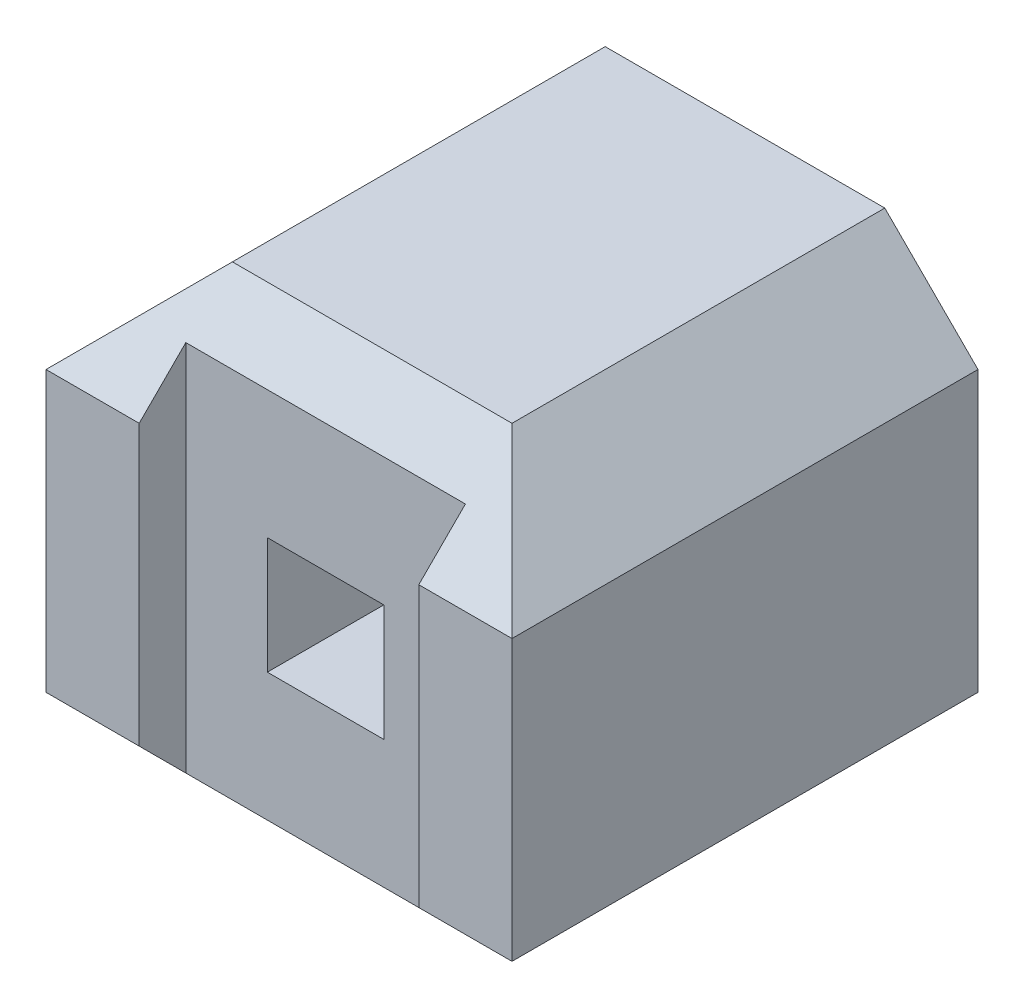
ISO-10303-21;
HEADER;
FILE_DESCRIPTION(('STEP AP214'),'2;1');
FILE_NAME('part.step','',(''),(''),'','','');
FILE_SCHEMA(('AUTOMOTIVE_DESIGN { 1 0 10303 214 1 1 1 1 }'));
ENDSEC;
DATA;
#1=APPLICATION_CONTEXT('core data for automotive mechanical design processes');
#2=APPLICATION_PROTOCOL_DEFINITION('international standard','automotive_design',2000,#1);
#3=PRODUCT_CONTEXT('',#1,'mechanical');
#4=PRODUCT('Part','Part','',(#3));
#5=PRODUCT_RELATED_PRODUCT_CATEGORY('part','',(#4));
#6=PRODUCT_DEFINITION_FORMATION('','',#4);
#7=PRODUCT_DEFINITION_CONTEXT('part definition',#1,'design');
#8=PRODUCT_DEFINITION('design','',#6,#7);
#9=PRODUCT_DEFINITION_SHAPE('','',#8);
#10=(LENGTH_UNIT() NAMED_UNIT(*) SI_UNIT(.MILLI.,.METRE.));
#11=(NAMED_UNIT(*) PLANE_ANGLE_UNIT() SI_UNIT($,.RADIAN.));
#12=(NAMED_UNIT(*) SI_UNIT($,.STERADIAN.) SOLID_ANGLE_UNIT());
#13=UNCERTAINTY_MEASURE_WITH_UNIT(LENGTH_MEASURE(1.E-05),#10,'distance_accuracy_value','');
#14=(GEOMETRIC_REPRESENTATION_CONTEXT(3) GLOBAL_UNCERTAINTY_ASSIGNED_CONTEXT((#13)) GLOBAL_UNIT_ASSIGNED_CONTEXT((#10,
#11,#12)) REPRESENTATION_CONTEXT('',''));
#15=CARTESIAN_POINT('',(0.,0.,0.));
#16=DIRECTION('',(0.,0.,1.));
#17=DIRECTION('',(1.,0.,0.));
#18=AXIS2_PLACEMENT_3D('',#15,#16,#17);
#19=CARTESIAN_POINT('',(1.27,3.81,2.54));
#20=DIRECTION('',(-1.,0.,0.));
#21=DIRECTION('',(0.,0.,1.));
#22=AXIS2_PLACEMENT_3D('',#19,#20,#21);
#23=PLANE('',#22);
#24=DIRECTION('',(0.,0.,1.));
#25=VECTOR('',#24,1.);
#26=CARTESIAN_POINT('',(1.27,5.842,2.54));
#27=LINE('',#26,#25);
#28=CARTESIAN_POINT('',(1.27,5.842,0.));
#29=VERTEX_POINT('',#28);
#30=CARTESIAN_POINT('',(1.27,5.842,2.54));
#31=VERTEX_POINT('',#30);
#32=EDGE_CURVE('E158',#29,#31,#27,.T.);
#33=ORIENTED_EDGE('',*,*,#32,.T.);
#34=DIRECTION('',(0.,1.,0.));
#35=VECTOR('',#34,1.);
#36=CARTESIAN_POINT('',(1.27,0.,2.54));
#37=LINE('',#36,#35);
#38=CARTESIAN_POINT('',(1.27,4.318,2.54));
#39=VERTEX_POINT('',#38);
#40=EDGE_CURVE('E127',#39,#31,#37,.T.);
#41=ORIENTED_EDGE('',*,*,#40,.F.);
#42=DIRECTION('',(0.,0.,1.));
#43=VECTOR('',#42,1.);
#44=CARTESIAN_POINT('',(1.27,4.318,2.54));
#45=LINE('',#44,#43);
#46=CARTESIAN_POINT('',(1.27,4.318,0.));
#47=VERTEX_POINT('',#46);
#48=EDGE_CURVE('E151',#39,#47,#45,.F.);
#49=ORIENTED_EDGE('',*,*,#48,.T.);
#50=DIRECTION('',(0.,1.,0.));
#51=VECTOR('',#50,1.);
#52=CARTESIAN_POINT('',(1.27,3.81,0.));
#53=LINE('',#52,#51);
#54=EDGE_CURVE('E19',#29,#47,#53,.F.);
#55=ORIENTED_EDGE('',*,*,#54,.F.);
#56=EDGE_LOOP('',(#33,#41,#49,#55));
#57=FACE_BOUND('',#56,.T.);
#58=ADVANCED_FACE('F16',(#57),#23,.F.);
#59=CARTESIAN_POINT('',(0.,0.,2.54));
#60=DIRECTION('',(0.,0.,1.));
#61=DIRECTION('',(1.,0.,0.));
#62=AXIS2_PLACEMENT_3D('',#59,#60,#61);
#63=PLANE('',#62);
#64=ORIENTED_EDGE('',*,*,#40,.T.);
#65=DIRECTION('',(1.,0.,0.));
#66=VECTOR('',#65,1.);
#67=CARTESIAN_POINT('',(0.,5.842,2.54));
#68=LINE('',#67,#66);
#69=CARTESIAN_POINT('',(0.762,5.842,2.54));
#70=VERTEX_POINT('',#69);
#71=EDGE_CURVE('E155',#31,#70,#68,.F.);
#72=ORIENTED_EDGE('',*,*,#71,.T.);
#73=DIRECTION('',(0.,-1.,0.));
#74=VECTOR('',#73,1.);
#75=CARTESIAN_POINT('',(0.762,6.35,2.54));
#76=LINE('',#75,#74);
#77=CARTESIAN_POINT('',(0.762,4.318,2.54));
#78=VERTEX_POINT('',#77);
#79=EDGE_CURVE('E134',#78,#70,#76,.F.);
#80=ORIENTED_EDGE('',*,*,#79,.F.);
#81=DIRECTION('',(1.,0.,0.));
#82=VECTOR('',#81,1.);
#83=CARTESIAN_POINT('',(0.,4.318,2.54));
#84=LINE('',#83,#82);
#85=EDGE_CURVE('E130',#78,#39,#84,.T.);
#86=ORIENTED_EDGE('',*,*,#85,.T.);
#87=EDGE_LOOP('',(#64,#72,#80,#86));
#88=FACE_BOUND('',#87,.T.);
#89=ADVANCED_FACE('F132',(#88),#63,.T.);
#90=CARTESIAN_POINT('',(1.27,4.318,2.54));
#91=DIRECTION('',(-0.707106781186548,0.707106781186548,0.));
#92=DIRECTION('',(-0.707106781186548,-0.707106781186548,0.));
#93=AXIS2_PLACEMENT_3D('',#90,#91,#92);
#94=PLANE('',#93);
#95=ORIENTED_EDGE('',*,*,#48,.F.);
#96=DIRECTION('',(0.577350269189626,0.577350269189626,0.577350269189626));
#97=VECTOR('',#96,1.);
#98=CARTESIAN_POINT('',(0.762,3.81,2.032));
#99=LINE('',#98,#97);
#100=CARTESIAN_POINT('',(0.762,3.81,2.032));
#101=VERTEX_POINT('',#100);
#102=EDGE_CURVE('E138',#101,#39,#99,.T.);
#103=ORIENTED_EDGE('',*,*,#102,.F.);
#104=DIRECTION('',(0.,0.,1.));
#105=VECTOR('',#104,1.);
#106=CARTESIAN_POINT('',(0.762,3.81,2.54));
#107=LINE('',#106,#105);
#108=CARTESIAN_POINT('',(0.762,3.81,0.));
#109=VERTEX_POINT('',#108);
#110=EDGE_CURVE('E182',#101,#109,#107,.F.);
#111=ORIENTED_EDGE('',*,*,#110,.T.);
#112=DIRECTION('',(-0.707106781186548,-0.707106781186548,0.));
#113=VECTOR('',#112,1.);
#114=CARTESIAN_POINT('',(1.27,4.318,0.));
#115=LINE('',#114,#113);
#116=EDGE_CURVE('E153',#47,#109,#115,.T.);
#117=ORIENTED_EDGE('',*,*,#116,.F.);
#118=EDGE_LOOP('',(#95,#103,#111,#117));
#119=FACE_BOUND('',#118,.T.);
#120=ADVANCED_FACE('F152',(#119),#94,.F.);
#121=CARTESIAN_POINT('',(0.762,6.35,2.54));
#122=DIRECTION('',(-0.707106781186547,-0.707106781186548,0.));
#123=DIRECTION('',(0.707106781186548,-0.707106781186547,0.));
#124=AXIS2_PLACEMENT_3D('',#121,#122,#123);
#125=PLANE('',#124);
#126=DIRECTION('',(0.,0.,-1.));
#127=VECTOR('',#126,1.);
#128=CARTESIAN_POINT('',(0.762,6.35,2.54));
#129=LINE('',#128,#127);
#130=CARTESIAN_POINT('',(0.762,6.35,0.));
#131=VERTEX_POINT('',#130);
#132=CARTESIAN_POINT('',(0.762,6.35,2.032));
#133=VERTEX_POINT('',#132);
#134=EDGE_CURVE('E186',#131,#133,#129,.F.);
#135=ORIENTED_EDGE('',*,*,#134,.T.);
#136=DIRECTION('',(-0.577350269189626,0.577350269189626,-0.577350269189626));
#137=VECTOR('',#136,1.);
#138=CARTESIAN_POINT('',(1.27,5.842,2.54));
#139=LINE('',#138,#137);
#140=EDGE_CURVE('E165',#31,#133,#139,.T.);
#141=ORIENTED_EDGE('',*,*,#140,.F.);
#142=ORIENTED_EDGE('',*,*,#32,.F.);
#143=DIRECTION('',(0.707106781186548,-0.707106781186547,0.));
#144=VECTOR('',#143,1.);
#145=CARTESIAN_POINT('',(0.762,6.35,0.));
#146=LINE('',#145,#144);
#147=EDGE_CURVE('E167',#131,#29,#146,.T.);
#148=ORIENTED_EDGE('',*,*,#147,.F.);
#149=EDGE_LOOP('',(#135,#141,#142,#148));
#150=FACE_BOUND('',#149,.T.);
#151=ADVANCED_FACE('F357',(#150),#125,.F.);
#152=CARTESIAN_POINT('',(0.762,6.35,2.286));
#153=DIRECTION('',(-1.,0.,0.));
#154=DIRECTION('',(0.,-1.,0.));
#155=AXIS2_PLACEMENT_3D('',#152,#153,#154);
#156=PLANE('',#155);
#157=ORIENTED_EDGE('',*,*,#79,.T.);
#158=DIRECTION('',(0.,-0.707106781186547,0.707106781186548));
#159=VECTOR('',#158,1.);
#160=CARTESIAN_POINT('',(0.762,5.842,2.54));
#161=LINE('',#160,#159);
#162=CARTESIAN_POINT('',(0.762,6.096,2.286));
#163=VERTEX_POINT('',#162);
#164=EDGE_CURVE('E196',#163,#70,#161,.T.);
#165=ORIENTED_EDGE('',*,*,#164,.F.);
#166=DIRECTION('',(0.,1.,0.));
#167=VECTOR('',#166,1.);
#168=CARTESIAN_POINT('',(0.762,0.,2.286));
#169=LINE('',#168,#167);
#170=CARTESIAN_POINT('',(0.762,4.064,2.286));
#171=VERTEX_POINT('',#170);
#172=EDGE_CURVE('E211',#163,#171,#169,.F.);
#173=ORIENTED_EDGE('',*,*,#172,.T.);
#174=DIRECTION('',(0.,-0.707106781186547,-0.707106781186548));
#175=VECTOR('',#174,1.);
#176=CARTESIAN_POINT('',(0.762,4.318,2.54));
#177=LINE('',#176,#175);
#178=EDGE_CURVE('E146',#78,#171,#177,.T.);
#179=ORIENTED_EDGE('',*,*,#178,.F.);
#180=EDGE_LOOP('',(#157,#165,#173,#179));
#181=FACE_BOUND('',#180,.T.);
#182=ADVANCED_FACE('F292',(#181),#156,.T.);
#183=CARTESIAN_POINT('',(-0.762,3.81,2.286));
#184=DIRECTION('',(1.,0.,0.));
#185=DIRECTION('',(0.,0.,-1.));
#186=AXIS2_PLACEMENT_3D('',#183,#184,#185);
#187=PLANE('',#186);
#188=DIRECTION('',(0.,1.,0.));
#189=VECTOR('',#188,1.);
#190=CARTESIAN_POINT('',(-0.762,0.,2.286));
#191=LINE('',#190,#189);
#192=CARTESIAN_POINT('',(-0.762,4.064,2.286));
#193=VERTEX_POINT('',#192);
#194=CARTESIAN_POINT('',(-0.762,6.096,2.286));
#195=VERTEX_POINT('',#194);
#196=EDGE_CURVE('E217',#193,#195,#191,.T.);
#197=ORIENTED_EDGE('',*,*,#196,.T.);
#198=DIRECTION('',(0.,-0.707106781186547,0.707106781186548));
#199=VECTOR('',#198,1.);
#200=CARTESIAN_POINT('',(-0.762,5.842,2.54));
#201=LINE('',#200,#199);
#202=CARTESIAN_POINT('',(-0.762,5.842,2.54));
#203=VERTEX_POINT('',#202);
#204=EDGE_CURVE('E194',#203,#195,#201,.F.);
#205=ORIENTED_EDGE('',*,*,#204,.F.);
#206=DIRECTION('',(0.,1.,0.));
#207=VECTOR('',#206,1.);
#208=CARTESIAN_POINT('',(-0.762,3.81,2.54));
#209=LINE('',#208,#207);
#210=CARTESIAN_POINT('',(-0.762,4.318,2.54));
#211=VERTEX_POINT('',#210);
#212=EDGE_CURVE('E171',#203,#211,#209,.F.);
#213=ORIENTED_EDGE('',*,*,#212,.T.);
#214=DIRECTION('',(0.,-0.707106781186547,-0.707106781186548));
#215=VECTOR('',#214,1.);
#216=CARTESIAN_POINT('',(-0.762,4.318,2.54));
#217=LINE('',#216,#215);
#218=EDGE_CURVE('E176',#193,#211,#217,.F.);
#219=ORIENTED_EDGE('',*,*,#218,.F.);
#220=EDGE_LOOP('',(#197,#205,#213,#219));
#221=FACE_BOUND('',#220,.T.);
#222=ADVANCED_FACE('F283',(#221),#187,.T.);
#223=CARTESIAN_POINT('',(0.3175,4.7625,2.794));
#224=DIRECTION('',(0.,-1.,0.));
#225=DIRECTION('',(0.,0.,-1.));
#226=AXIS2_PLACEMENT_3D('',#223,#224,#225);
#227=PLANE('',#226);
#228=DIRECTION('',(-1.,0.,0.));
#229=VECTOR('',#228,1.);
#230=CARTESIAN_POINT('',(0.,4.7625,2.286));
#231=LINE('',#230,#229);
#232=CARTESIAN_POINT('',(-0.3175,4.7625,2.286));
#233=VERTEX_POINT('',#232);
#234=CARTESIAN_POINT('',(0.3175,4.7625,2.286));
#235=VERTEX_POINT('',#234);
#236=EDGE_CURVE('E209',#233,#235,#231,.F.);
#237=ORIENTED_EDGE('',*,*,#236,.T.);
#238=DIRECTION('',(0.,0.,-1.));
#239=VECTOR('',#238,1.);
#240=CARTESIAN_POINT('',(0.3175,4.7625,2.794));
#241=LINE('',#240,#239);
#242=CARTESIAN_POINT('',(0.3175,4.7625,0.));
#243=VERTEX_POINT('',#242);
#244=EDGE_CURVE('E228',#235,#243,#241,.T.);
#245=ORIENTED_EDGE('',*,*,#244,.T.);
#246=DIRECTION('',(1.,0.,0.));
#247=VECTOR('',#246,1.);
#248=CARTESIAN_POINT('',(0.3175,4.7625,0.));
#249=LINE('',#248,#247);
#250=CARTESIAN_POINT('',(-0.3175,4.7625,0.));
#251=VERTEX_POINT('',#250);
#252=EDGE_CURVE('E173',#251,#243,#249,.T.);
#253=ORIENTED_EDGE('',*,*,#252,.F.);
#254=DIRECTION('',(0.,0.,1.));
#255=VECTOR('',#254,1.);
#256=CARTESIAN_POINT('',(-0.3175,4.7625,2.794));
#257=LINE('',#256,#255);
#258=EDGE_CURVE('E204',#251,#233,#257,.T.);
#259=ORIENTED_EDGE('',*,*,#258,.T.);
#260=EDGE_LOOP('',(#237,#245,#253,#259));
#261=FACE_BOUND('',#260,.T.);
#262=ADVANCED_FACE('F281',(#261),#227,.F.);
#263=CARTESIAN_POINT('',(0.,4.318,2.54));
#264=DIRECTION('',(0.,-0.707106781186548,0.707106781186547));
#265=DIRECTION('',(0.,-0.707106781186547,-0.707106781186548));
#266=AXIS2_PLACEMENT_3D('',#263,#264,#265);
#267=PLANE('',#266);
#268=ORIENTED_EDGE('',*,*,#85,.F.);
#269=ORIENTED_EDGE('',*,*,#178,.T.);
#270=DIRECTION('',(-1.,0.,0.));
#271=VECTOR('',#270,1.);
#272=CARTESIAN_POINT('',(0.,4.064,2.286));
#273=LINE('',#272,#271);
#274=EDGE_CURVE('E214',#171,#193,#273,.T.);
#275=ORIENTED_EDGE('',*,*,#274,.T.);
#276=ORIENTED_EDGE('',*,*,#218,.T.);
#277=DIRECTION('',(1.,0.,0.));
#278=VECTOR('',#277,1.);
#279=CARTESIAN_POINT('',(0.,4.318,2.54));
#280=LINE('',#279,#278);
#281=CARTESIAN_POINT('',(-1.27,4.318,2.54));
#282=VERTEX_POINT('',#281);
#283=EDGE_CURVE('E147',#211,#282,#280,.F.);
#284=ORIENTED_EDGE('',*,*,#283,.T.);
#285=DIRECTION('',(0.577350269189626,-0.577350269189626,-0.577350269189626));
#286=VECTOR('',#285,1.);
#287=CARTESIAN_POINT('',(-1.27,4.318,2.54));
#288=LINE('',#287,#286);
#289=CARTESIAN_POINT('',(-0.762,3.81,2.032));
#290=VERTEX_POINT('',#289);
#291=EDGE_CURVE('E231',#282,#290,#288,.T.);
#292=ORIENTED_EDGE('',*,*,#291,.T.);
#293=DIRECTION('',(1.,0.,0.));
#294=VECTOR('',#293,1.);
#295=CARTESIAN_POINT('',(-1.27,3.81,2.032));
#296=LINE('',#295,#294);
#297=EDGE_CURVE('E142',#290,#101,#296,.T.);
#298=ORIENTED_EDGE('',*,*,#297,.T.);
#299=ORIENTED_EDGE('',*,*,#102,.T.);
#300=EDGE_LOOP('',(#268,#269,#275,#276,#284,#292,#298,#299));
#301=FACE_BOUND('',#300,.T.);
#302=ADVANCED_FACE('F140',(#301),#267,.T.);
#303=CARTESIAN_POINT('',(-1.27,3.81,2.54));
#304=DIRECTION('',(0.,1.,0.));
#305=DIRECTION('',(0.,0.,1.));
#306=AXIS2_PLACEMENT_3D('',#303,#304,#305);
#307=PLANE('',#306);
#308=ORIENTED_EDGE('',*,*,#110,.F.);
#309=ORIENTED_EDGE('',*,*,#297,.F.);
#310=DIRECTION('',(0.,0.,1.));
#311=VECTOR('',#310,1.);
#312=CARTESIAN_POINT('',(-0.762,3.81,2.54));
#313=LINE('',#312,#311);
#314=CARTESIAN_POINT('',(-0.762,3.81,0.));
#315=VERTEX_POINT('',#314);
#316=EDGE_CURVE('E233',#290,#315,#313,.F.);
#317=ORIENTED_EDGE('',*,*,#316,.T.);
#318=DIRECTION('',(1.,0.,0.));
#319=VECTOR('',#318,1.);
#320=CARTESIAN_POINT('',(-1.27,3.81,0.));
#321=LINE('',#320,#319);
#322=EDGE_CURVE('E184',#109,#315,#321,.F.);
#323=ORIENTED_EDGE('',*,*,#322,.F.);
#324=EDGE_LOOP('',(#308,#309,#317,#323));
#325=FACE_BOUND('',#324,.T.);
#326=ADVANCED_FACE('F290',(#325),#307,.F.);
#327=CARTESIAN_POINT('',(1.27,6.35,2.54));
#328=DIRECTION('',(0.,-1.,0.));
#329=DIRECTION('',(0.,0.,-1.));
#330=AXIS2_PLACEMENT_3D('',#327,#328,#329);
#331=PLANE('',#330);
#332=DIRECTION('',(0.,0.,1.));
#333=VECTOR('',#332,1.);
#334=CARTESIAN_POINT('',(-0.762,6.35,2.54));
#335=LINE('',#334,#333);
#336=CARTESIAN_POINT('',(-0.762,6.35,0.));
#337=VERTEX_POINT('',#336);
#338=CARTESIAN_POINT('',(-0.762,6.35,2.032));
#339=VERTEX_POINT('',#338);
#340=EDGE_CURVE('E238',#337,#339,#335,.T.);
#341=ORIENTED_EDGE('',*,*,#340,.T.);
#342=DIRECTION('',(1.,0.,0.));
#343=VECTOR('',#342,1.);
#344=CARTESIAN_POINT('',(0.,6.35,2.032));
#345=LINE('',#344,#343);
#346=EDGE_CURVE('E199',#133,#339,#345,.F.);
#347=ORIENTED_EDGE('',*,*,#346,.F.);
#348=ORIENTED_EDGE('',*,*,#134,.F.);
#349=DIRECTION('',(1.,0.,0.));
#350=VECTOR('',#349,1.);
#351=CARTESIAN_POINT('',(1.27,6.35,0.));
#352=LINE('',#351,#350);
#353=EDGE_CURVE('E189',#337,#131,#352,.T.);
#354=ORIENTED_EDGE('',*,*,#353,.F.);
#355=EDGE_LOOP('',(#341,#347,#348,#354));
#356=FACE_BOUND('',#355,.T.);
#357=ADVANCED_FACE('F328',(#356),#331,.F.);
#358=CARTESIAN_POINT('',(0.,5.842,2.54));
#359=DIRECTION('',(0.,0.707106781186548,0.707106781186547));
#360=DIRECTION('',(0.,-0.707106781186547,0.707106781186548));
#361=AXIS2_PLACEMENT_3D('',#358,#359,#360);
#362=PLANE('',#361);
#363=ORIENTED_EDGE('',*,*,#346,.T.);
#364=DIRECTION('',(-0.577350269189626,-0.577350269189626,0.577350269189626));
#365=VECTOR('',#364,1.);
#366=CARTESIAN_POINT('',(-0.762,6.35,2.032));
#367=LINE('',#366,#365);
#368=CARTESIAN_POINT('',(-1.27,5.842,2.54));
#369=VERTEX_POINT('',#368);
#370=EDGE_CURVE('E241',#339,#369,#367,.T.);
#371=ORIENTED_EDGE('',*,*,#370,.T.);
#372=DIRECTION('',(1.,0.,0.));
#373=VECTOR('',#372,1.);
#374=CARTESIAN_POINT('',(0.,5.842,2.54));
#375=LINE('',#374,#373);
#376=EDGE_CURVE('E192',#369,#203,#375,.T.);
#377=ORIENTED_EDGE('',*,*,#376,.T.);
#378=ORIENTED_EDGE('',*,*,#204,.T.);
#379=DIRECTION('',(-1.,0.,0.));
#380=VECTOR('',#379,1.);
#381=CARTESIAN_POINT('',(0.,6.096,2.286));
#382=LINE('',#381,#380);
#383=EDGE_CURVE('E220',#195,#163,#382,.F.);
#384=ORIENTED_EDGE('',*,*,#383,.T.);
#385=ORIENTED_EDGE('',*,*,#164,.T.);
#386=ORIENTED_EDGE('',*,*,#71,.F.);
#387=ORIENTED_EDGE('',*,*,#140,.T.);
#388=EDGE_LOOP('',(#363,#371,#377,#378,#384,#385,#386,#387));
#389=FACE_BOUND('',#388,.T.);
#390=ADVANCED_FACE('F325',(#389),#362,.T.);
#391=CARTESIAN_POINT('',(-0.3175,4.7625,2.794));
#392=DIRECTION('',(-1.,0.,0.));
#393=DIRECTION('',(0.,0.,1.));
#394=AXIS2_PLACEMENT_3D('',#391,#392,#393);
#395=PLANE('',#394);
#396=DIRECTION('',(0.,1.,0.));
#397=VECTOR('',#396,1.);
#398=CARTESIAN_POINT('',(-0.3175,0.,2.286));
#399=LINE('',#398,#397);
#400=CARTESIAN_POINT('',(-0.3175,5.3975,2.286));
#401=VERTEX_POINT('',#400);
#402=EDGE_CURVE('E206',#401,#233,#399,.F.);
#403=ORIENTED_EDGE('',*,*,#402,.T.);
#404=ORIENTED_EDGE('',*,*,#258,.F.);
#405=DIRECTION('',(0.,1.,0.));
#406=VECTOR('',#405,1.);
#407=CARTESIAN_POINT('',(-0.3175,4.7625,0.));
#408=LINE('',#407,#406);
#409=CARTESIAN_POINT('',(-0.3175,5.3975,0.));
#410=VERTEX_POINT('',#409);
#411=EDGE_CURVE('E201',#410,#251,#408,.F.);
#412=ORIENTED_EDGE('',*,*,#411,.F.);
#413=DIRECTION('',(0.,0.,1.));
#414=VECTOR('',#413,1.);
#415=CARTESIAN_POINT('',(-0.3175,5.3975,2.794));
#416=LINE('',#415,#414);
#417=EDGE_CURVE('E245',#410,#401,#416,.T.);
#418=ORIENTED_EDGE('',*,*,#417,.T.);
#419=EDGE_LOOP('',(#403,#404,#412,#418));
#420=FACE_BOUND('',#419,.T.);
#421=ADVANCED_FACE('F278',(#420),#395,.F.);
#422=CARTESIAN_POINT('',(0.,0.,2.286));
#423=DIRECTION('',(0.,0.,-1.));
#424=DIRECTION('',(-1.,0.,0.));
#425=AXIS2_PLACEMENT_3D('',#422,#423,#424);
#426=PLANE('',#425);
#427=ORIENTED_EDGE('',*,*,#196,.F.);
#428=ORIENTED_EDGE('',*,*,#274,.F.);
#429=ORIENTED_EDGE('',*,*,#172,.F.);
#430=ORIENTED_EDGE('',*,*,#383,.F.);
#431=EDGE_LOOP('',(#427,#428,#429,#430));
#432=FACE_BOUND('',#431,.T.);
#433=ORIENTED_EDGE('',*,*,#402,.F.);
#434=DIRECTION('',(1.,0.,0.));
#435=VECTOR('',#434,1.);
#436=CARTESIAN_POINT('',(-0.3175,5.3975,2.286));
#437=LINE('',#436,#435);
#438=CARTESIAN_POINT('',(0.3175,5.3975,2.286));
#439=VERTEX_POINT('',#438);
#440=EDGE_CURVE('E248',#401,#439,#437,.T.);
#441=ORIENTED_EDGE('',*,*,#440,.T.);
#442=DIRECTION('',(0.,1.,0.));
#443=VECTOR('',#442,1.);
#444=CARTESIAN_POINT('',(0.3175,5.3975,2.286));
#445=LINE('',#444,#443);
#446=EDGE_CURVE('E225',#439,#235,#445,.F.);
#447=ORIENTED_EDGE('',*,*,#446,.T.);
#448=ORIENTED_EDGE('',*,*,#236,.F.);
#449=EDGE_LOOP('',(#433,#441,#447,#448));
#450=FACE_BOUND('',#449,.T.);
#451=ADVANCED_FACE('F276',(#432,#450),#426,.F.);
#452=CARTESIAN_POINT('',(0.3175,5.3975,2.794));
#453=DIRECTION('',(1.,0.,0.));
#454=DIRECTION('',(0.,0.,-1.));
#455=AXIS2_PLACEMENT_3D('',#452,#453,#454);
#456=PLANE('',#455);
#457=ORIENTED_EDGE('',*,*,#446,.F.);
#458=DIRECTION('',(0.,0.,1.));
#459=VECTOR('',#458,1.);
#460=CARTESIAN_POINT('',(0.3175,5.3975,2.794));
#461=LINE('',#460,#459);
#462=CARTESIAN_POINT('',(0.3175,5.3975,0.));
#463=VERTEX_POINT('',#462);
#464=EDGE_CURVE('E251',#439,#463,#461,.F.);
#465=ORIENTED_EDGE('',*,*,#464,.T.);
#466=DIRECTION('',(0.,1.,0.));
#467=VECTOR('',#466,1.);
#468=CARTESIAN_POINT('',(0.3175,5.3975,0.));
#469=LINE('',#468,#467);
#470=EDGE_CURVE('E223',#243,#463,#469,.T.);
#471=ORIENTED_EDGE('',*,*,#470,.F.);
#472=ORIENTED_EDGE('',*,*,#244,.F.);
#473=EDGE_LOOP('',(#457,#465,#471,#472));
#474=FACE_BOUND('',#473,.T.);
#475=ADVANCED_FACE('F273',(#474),#456,.F.);
#476=CARTESIAN_POINT('',(-0.762,3.81,2.54));
#477=DIRECTION('',(0.707106781186547,0.707106781186548,0.));
#478=DIRECTION('',(-0.707106781186548,0.707106781186547,0.));
#479=AXIS2_PLACEMENT_3D('',#476,#477,#478);
#480=PLANE('',#479);
#481=ORIENTED_EDGE('',*,*,#316,.F.);
#482=ORIENTED_EDGE('',*,*,#291,.F.);
#483=DIRECTION('',(0.,0.,-1.));
#484=VECTOR('',#483,1.);
#485=CARTESIAN_POINT('',(-1.27,4.318,2.54));
#486=LINE('',#485,#484);
#487=CARTESIAN_POINT('',(-1.27,4.318,0.));
#488=VERTEX_POINT('',#487);
#489=EDGE_CURVE('E254',#282,#488,#486,.T.);
#490=ORIENTED_EDGE('',*,*,#489,.T.);
#491=DIRECTION('',(-0.707106781186548,0.707106781186547,0.));
#492=VECTOR('',#491,1.);
#493=CARTESIAN_POINT('',(-0.762,3.81,0.));
#494=LINE('',#493,#492);
#495=EDGE_CURVE('E236',#315,#488,#494,.T.);
#496=ORIENTED_EDGE('',*,*,#495,.F.);
#497=EDGE_LOOP('',(#481,#482,#490,#496));
#498=FACE_BOUND('',#497,.T.);
#499=ADVANCED_FACE('F314',(#498),#480,.F.);
#500=CARTESIAN_POINT('',(-1.27,5.842,2.54));
#501=DIRECTION('',(0.707106781186548,-0.707106781186548,0.));
#502=DIRECTION('',(0.707106781186548,0.707106781186548,0.));
#503=AXIS2_PLACEMENT_3D('',#500,#501,#502);
#504=PLANE('',#503);
#505=DIRECTION('',(0.,0.,-1.));
#506=VECTOR('',#505,1.);
#507=CARTESIAN_POINT('',(-1.27,5.842,2.54));
#508=LINE('',#507,#506);
#509=CARTESIAN_POINT('',(-1.27,5.842,0.));
#510=VERTEX_POINT('',#509);
#511=EDGE_CURVE('E257',#510,#369,#508,.F.);
#512=ORIENTED_EDGE('',*,*,#511,.T.);
#513=ORIENTED_EDGE('',*,*,#370,.F.);
#514=ORIENTED_EDGE('',*,*,#340,.F.);
#515=DIRECTION('',(0.707106781186548,0.707106781186548,0.));
#516=VECTOR('',#515,1.);
#517=CARTESIAN_POINT('',(-1.27,5.842,0.));
#518=LINE('',#517,#516);
#519=EDGE_CURVE('E34',#510,#337,#518,.T.);
#520=ORIENTED_EDGE('',*,*,#519,.F.);
#521=EDGE_LOOP('',(#512,#513,#514,#520));
#522=FACE_BOUND('',#521,.T.);
#523=ADVANCED_FACE('F310',(#522),#504,.F.);
#524=CARTESIAN_POINT('',(0.,0.,2.54));
#525=DIRECTION('',(0.,0.,1.));
#526=DIRECTION('',(1.,0.,0.));
#527=AXIS2_PLACEMENT_3D('',#524,#525,#526);
#528=PLANE('',#527);
#529=DIRECTION('',(0.,1.,0.));
#530=VECTOR('',#529,1.);
#531=CARTESIAN_POINT('',(-1.27,6.35,2.54));
#532=LINE('',#531,#530);
#533=EDGE_CURVE('E259',#369,#282,#532,.F.);
#534=ORIENTED_EDGE('',*,*,#533,.T.);
#535=ORIENTED_EDGE('',*,*,#283,.F.);
#536=ORIENTED_EDGE('',*,*,#212,.F.);
#537=ORIENTED_EDGE('',*,*,#376,.F.);
#538=EDGE_LOOP('',(#534,#535,#536,#537));
#539=FACE_BOUND('',#538,.T.);
#540=ADVANCED_FACE('F307',(#539),#528,.T.);
#541=CARTESIAN_POINT('',(-0.3175,5.3975,2.794));
#542=DIRECTION('',(0.,1.,0.));
#543=DIRECTION('',(0.,0.,1.));
#544=AXIS2_PLACEMENT_3D('',#541,#542,#543);
#545=PLANE('',#544);
#546=ORIENTED_EDGE('',*,*,#440,.F.);
#547=ORIENTED_EDGE('',*,*,#417,.F.);
#548=DIRECTION('',(1.,0.,0.));
#549=VECTOR('',#548,1.);
#550=CARTESIAN_POINT('',(0.,5.3975,0.));
#551=LINE('',#550,#549);
#552=EDGE_CURVE('E25',#410,#463,#551,.T.);
#553=ORIENTED_EDGE('',*,*,#552,.T.);
#554=ORIENTED_EDGE('',*,*,#464,.F.);
#555=EDGE_LOOP('',(#546,#547,#553,#554));
#556=FACE_BOUND('',#555,.T.);
#557=ADVANCED_FACE('F268',(#556),#545,.F.);
#558=CARTESIAN_POINT('',(-1.27,6.35,2.54));
#559=DIRECTION('',(1.,0.,0.));
#560=DIRECTION('',(0.,0.,-1.));
#561=AXIS2_PLACEMENT_3D('',#558,#559,#560);
#562=PLANE('',#561);
#563=ORIENTED_EDGE('',*,*,#511,.F.);
#564=DIRECTION('',(0.,1.,0.));
#565=VECTOR('',#564,1.);
#566=CARTESIAN_POINT('',(-1.27,0.,0.));
#567=LINE('',#566,#565);
#568=EDGE_CURVE('E11',#510,#488,#567,.F.);
#569=ORIENTED_EDGE('',*,*,#568,.T.);
#570=ORIENTED_EDGE('',*,*,#489,.F.);
#571=ORIENTED_EDGE('',*,*,#533,.F.);
#572=EDGE_LOOP('',(#563,#569,#570,#571));
#573=FACE_BOUND('',#572,.T.);
#574=ADVANCED_FACE('F296',(#573),#562,.F.);
#575=CARTESIAN_POINT('',(0.,0.,0.));
#576=DIRECTION('',(0.,0.,1.));
#577=DIRECTION('',(1.,0.,0.));
#578=AXIS2_PLACEMENT_3D('',#575,#576,#577);
#579=PLANE('',#578);
#580=ORIENTED_EDGE('',*,*,#519,.T.);
#581=ORIENTED_EDGE('',*,*,#353,.T.);
#582=ORIENTED_EDGE('',*,*,#147,.T.);
#583=ORIENTED_EDGE('',*,*,#54,.T.);
#584=ORIENTED_EDGE('',*,*,#116,.T.);
#585=ORIENTED_EDGE('',*,*,#322,.T.);
#586=ORIENTED_EDGE('',*,*,#495,.T.);
#587=ORIENTED_EDGE('',*,*,#568,.F.);
#588=EDGE_LOOP('',(#580,#581,#582,#583,#584,#585,#586,#587));
#589=FACE_BOUND('',#588,.T.);
#590=ORIENTED_EDGE('',*,*,#411,.T.);
#591=ORIENTED_EDGE('',*,*,#252,.T.);
#592=ORIENTED_EDGE('',*,*,#470,.T.);
#593=ORIENTED_EDGE('',*,*,#552,.F.);
#594=EDGE_LOOP('',(#590,#591,#592,#593));
#595=FACE_BOUND('',#594,.T.);
#596=ADVANCED_FACE('F270',(#589,#595),#579,.F.);
#597=CLOSED_SHELL('',(#58,#89,#120,#151,#182,#222,#262,#302,#326,#357,#390,#421,#451,#475,#499,
#523,#540,#557,#574,#596));
#598=MANIFOLD_SOLID_BREP('B1',#597);
#599=ADVANCED_BREP_SHAPE_REPRESENTATION('',(#18,#598),#14);
#600=SHAPE_DEFINITION_REPRESENTATION(#9,#599);
ENDSEC;
END-ISO-10303-21;
